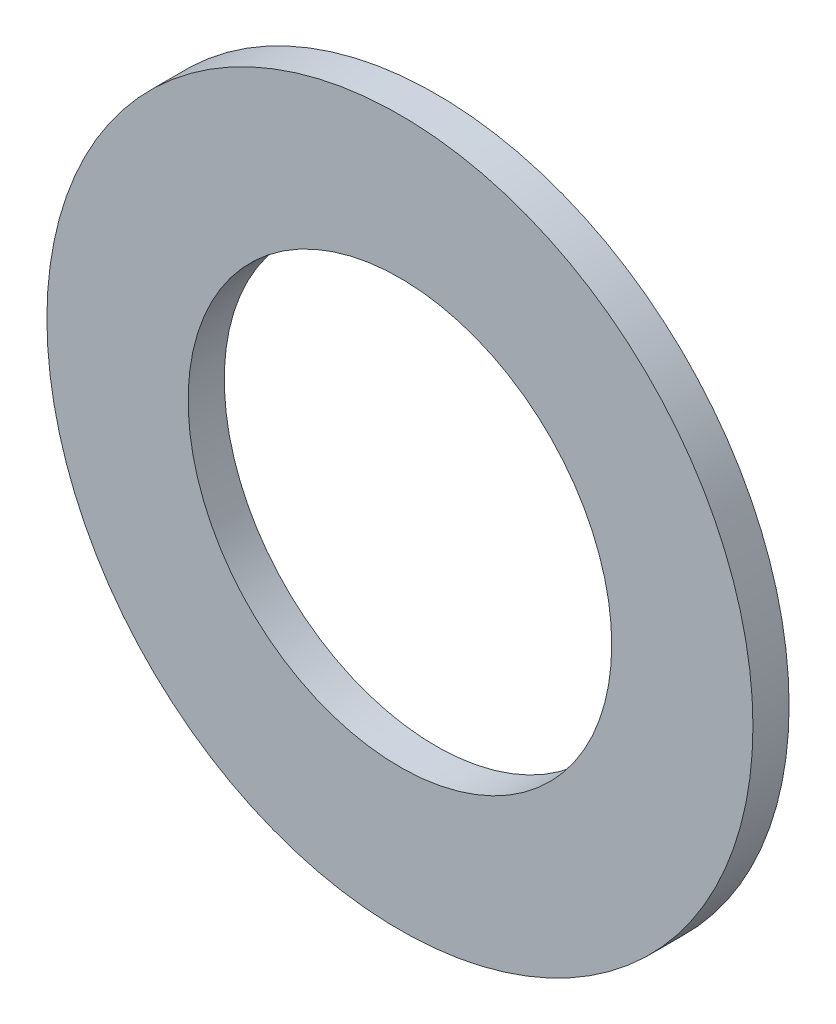
ISO-10303-21;
HEADER;
FILE_DESCRIPTION(('STEP AP214'),'2;1');
FILE_NAME('part.step','',(''),(''),'','','');
FILE_SCHEMA(('AUTOMOTIVE_DESIGN { 1 0 10303 214 1 1 1 1 }'));
ENDSEC;
DATA;
#1=APPLICATION_CONTEXT('core data for automotive mechanical design processes');
#2=APPLICATION_PROTOCOL_DEFINITION('international standard','automotive_design',2000,#1);
#3=PRODUCT_CONTEXT('',#1,'mechanical');
#4=PRODUCT('Part','Part','',(#3));
#5=PRODUCT_RELATED_PRODUCT_CATEGORY('part','',(#4));
#6=PRODUCT_DEFINITION_FORMATION('','',#4);
#7=PRODUCT_DEFINITION_CONTEXT('part definition',#1,'design');
#8=PRODUCT_DEFINITION('design','',#6,#7);
#9=PRODUCT_DEFINITION_SHAPE('','',#8);
#10=(LENGTH_UNIT() NAMED_UNIT(*) SI_UNIT(.MILLI.,.METRE.));
#11=(NAMED_UNIT(*) PLANE_ANGLE_UNIT() SI_UNIT($,.RADIAN.));
#12=(NAMED_UNIT(*) SI_UNIT($,.STERADIAN.) SOLID_ANGLE_UNIT());
#13=UNCERTAINTY_MEASURE_WITH_UNIT(LENGTH_MEASURE(1.E-05),#10,'distance_accuracy_value','');
#14=(GEOMETRIC_REPRESENTATION_CONTEXT(3) GLOBAL_UNCERTAINTY_ASSIGNED_CONTEXT((#13)) GLOBAL_UNIT_ASSIGNED_CONTEXT((#10,
#11,#12)) REPRESENTATION_CONTEXT('',''));
#15=CARTESIAN_POINT('',(0.,0.,0.));
#16=DIRECTION('',(0.,0.,1.));
#17=DIRECTION('',(1.,0.,0.));
#18=AXIS2_PLACEMENT_3D('',#15,#16,#17);
#19=CARTESIAN_POINT('',(0.,0.,0.8128));
#20=DIRECTION('',(0.,0.,1.));
#21=DIRECTION('',(1.,0.,0.));
#22=AXIS2_PLACEMENT_3D('',#19,#20,#21);
#23=PLANE('',#22);
#24=CARTESIAN_POINT('',(0.,0.,0.8128));
#25=DIRECTION('',(0.,0.,1.));
#26=DIRECTION('',(1.,0.,0.));
#27=AXIS2_PLACEMENT_3D('',#24,#25,#26);
#28=CIRCLE('',#27,7.9375);
#29=CARTESIAN_POINT('',(7.9375,0.,0.8128));
#30=VERTEX_POINT('',#29);
#31=EDGE_CURVE('E10',#30,#30,#28,.T.);
#32=ORIENTED_EDGE('',*,*,#31,.T.);
#33=EDGE_LOOP('',(#32));
#34=FACE_BOUND('',#33,.T.);
#35=CARTESIAN_POINT('',(0.,0.,0.8128));
#36=DIRECTION('',(0.,0.,1.));
#37=DIRECTION('',(1.,0.,0.));
#38=AXIS2_PLACEMENT_3D('',#35,#36,#37);
#39=CIRCLE('',#38,4.7625);
#40=CARTESIAN_POINT('',(4.7625,0.,0.8128));
#41=VERTEX_POINT('',#40);
#42=EDGE_CURVE('E42',#41,#41,#39,.T.);
#43=ORIENTED_EDGE('',*,*,#42,.F.);
#44=EDGE_LOOP('',(#43));
#45=FACE_BOUND('',#44,.T.);
#46=ADVANCED_FACE('F31',(#34,#45),#23,.T.);
#47=CARTESIAN_POINT('',(0.,0.,0.));
#48=DIRECTION('',(0.,0.,1.));
#49=DIRECTION('',(1.,0.,0.));
#50=AXIS2_PLACEMENT_3D('',#47,#48,#49);
#51=PLANE('',#50);
#52=CARTESIAN_POINT('',(0.,0.,0.));
#53=DIRECTION('',(0.,0.,1.));
#54=DIRECTION('',(1.,0.,0.));
#55=AXIS2_PLACEMENT_3D('',#52,#53,#54);
#56=CIRCLE('',#55,7.9375);
#57=CARTESIAN_POINT('',(7.9375,0.,0.));
#58=VERTEX_POINT('',#57);
#59=EDGE_CURVE('E35',#58,#58,#56,.T.);
#60=ORIENTED_EDGE('',*,*,#59,.F.);
#61=EDGE_LOOP('',(#60));
#62=FACE_BOUND('',#61,.T.);
#63=CARTESIAN_POINT('',(0.,0.,0.));
#64=DIRECTION('',(0.,0.,1.));
#65=DIRECTION('',(1.,0.,0.));
#66=AXIS2_PLACEMENT_3D('',#63,#64,#65);
#67=CIRCLE('',#66,4.7625);
#68=CARTESIAN_POINT('',(4.7625,0.,0.));
#69=VERTEX_POINT('',#68);
#70=EDGE_CURVE('E44',#69,#69,#67,.T.);
#71=ORIENTED_EDGE('',*,*,#70,.T.);
#72=EDGE_LOOP('',(#71));
#73=FACE_BOUND('',#72,.T.);
#74=ADVANCED_FACE('F54',(#62,#73),#51,.F.);
#75=CARTESIAN_POINT('',(0.,0.,0.8128));
#76=DIRECTION('',(0.,0.,-1.));
#77=DIRECTION('',(-1.,0.,0.));
#78=AXIS2_PLACEMENT_3D('',#75,#76,#77);
#79=CYLINDRICAL_SURFACE('',#78,7.9375);
#80=ORIENTED_EDGE('',*,*,#31,.F.);
#81=EDGE_LOOP('',(#80));
#82=FACE_BOUND('',#81,.T.);
#83=ORIENTED_EDGE('',*,*,#59,.T.);
#84=EDGE_LOOP('',(#83));
#85=FACE_BOUND('',#84,.T.);
#86=ADVANCED_FACE('F33',(#82,#85),#79,.T.);
#87=CARTESIAN_POINT('',(0.,0.,0.8128));
#88=DIRECTION('',(0.,0.,-1.));
#89=DIRECTION('',(-1.,0.,0.));
#90=AXIS2_PLACEMENT_3D('',#87,#88,#89);
#91=CYLINDRICAL_SURFACE('',#90,4.7625);
#92=ORIENTED_EDGE('',*,*,#42,.T.);
#93=EDGE_LOOP('',(#92));
#94=FACE_BOUND('',#93,.T.);
#95=ORIENTED_EDGE('',*,*,#70,.F.);
#96=EDGE_LOOP('',(#95));
#97=FACE_BOUND('',#96,.T.);
#98=ADVANCED_FACE('F50',(#94,#97),#91,.F.);
#99=CLOSED_SHELL('',(#46,#74,#86,#98));
#100=MANIFOLD_SOLID_BREP('B2',#99);
#101=ADVANCED_BREP_SHAPE_REPRESENTATION('',(#18,#100),#14);
#102=SHAPE_DEFINITION_REPRESENTATION(#9,#101);
ENDSEC;
END-ISO-10303-21;
